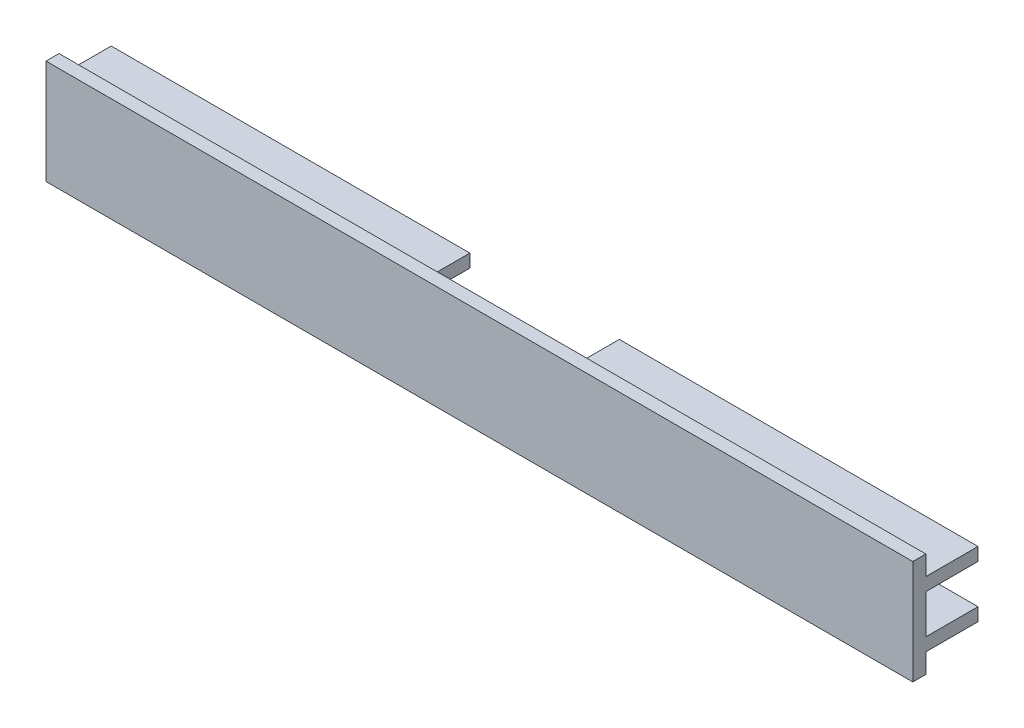
ISO-10303-21;
HEADER;
FILE_DESCRIPTION(('STEP AP214'),'2;1');
FILE_NAME('part.step','',(''),(''),'','','');
FILE_SCHEMA(('AUTOMOTIVE_DESIGN { 1 0 10303 214 1 1 1 1 }'));
ENDSEC;
DATA;
#1=APPLICATION_CONTEXT('core data for automotive mechanical design processes');
#2=APPLICATION_PROTOCOL_DEFINITION('international standard','automotive_design',2000,#1);
#3=PRODUCT_CONTEXT('',#1,'mechanical');
#4=PRODUCT('Part','Part','',(#3));
#5=PRODUCT_RELATED_PRODUCT_CATEGORY('part','',(#4));
#6=PRODUCT_DEFINITION_FORMATION('','',#4);
#7=PRODUCT_DEFINITION_CONTEXT('part definition',#1,'design');
#8=PRODUCT_DEFINITION('design','',#6,#7);
#9=PRODUCT_DEFINITION_SHAPE('','',#8);
#10=(LENGTH_UNIT() NAMED_UNIT(*) SI_UNIT(.MILLI.,.METRE.));
#11=(NAMED_UNIT(*) PLANE_ANGLE_UNIT() SI_UNIT($,.RADIAN.));
#12=(NAMED_UNIT(*) SI_UNIT($,.STERADIAN.) SOLID_ANGLE_UNIT());
#13=UNCERTAINTY_MEASURE_WITH_UNIT(LENGTH_MEASURE(1.E-05),#10,'distance_accuracy_value','');
#14=(GEOMETRIC_REPRESENTATION_CONTEXT(3) GLOBAL_UNCERTAINTY_ASSIGNED_CONTEXT((#13)) GLOBAL_UNIT_ASSIGNED_CONTEXT((#10,
#11,#12)) REPRESENTATION_CONTEXT('',''));
#15=CARTESIAN_POINT('',(0.,0.,0.));
#16=DIRECTION('',(0.,0.,1.));
#17=DIRECTION('',(1.,0.,0.));
#18=AXIS2_PLACEMENT_3D('',#15,#16,#17);
#19=CARTESIAN_POINT('',(66.46,-3.,-5.));
#20=DIRECTION('',(0.,0.,1.));
#21=DIRECTION('',(1.,0.,0.));
#22=AXIS2_PLACEMENT_3D('',#19,#20,#21);
#23=PLANE('',#22);
#24=DIRECTION('',(-1.,0.,0.));
#25=VECTOR('',#24,1.);
#26=CARTESIAN_POINT('',(66.46,-5.,-5.));
#27=LINE('',#26,#25);
#28=CARTESIAN_POINT('',(66.46,-5.,-5.));
#29=VERTEX_POINT('',#28);
#30=CARTESIAN_POINT('',(11.46,-5.,-5.));
#31=VERTEX_POINT('',#30);
#32=EDGE_CURVE('E353',#29,#31,#27,.T.);
#33=ORIENTED_EDGE('',*,*,#32,.T.);
#34=DIRECTION('',(0.,-1.,0.));
#35=VECTOR('',#34,1.);
#36=CARTESIAN_POINT('',(11.46,5.,-5.));
#37=LINE('',#36,#35);
#38=CARTESIAN_POINT('',(11.46,-3.,-5.));
#39=VERTEX_POINT('',#38);
#40=EDGE_CURVE('E420',#39,#31,#37,.T.);
#41=ORIENTED_EDGE('',*,*,#40,.F.);
#42=DIRECTION('',(-1.,0.,0.));
#43=VECTOR('',#42,1.);
#44=CARTESIAN_POINT('',(66.46,-3.,-5.));
#45=LINE('',#44,#43);
#46=CARTESIAN_POINT('',(66.46,-3.,-5.));
#47=VERTEX_POINT('',#46);
#48=EDGE_CURVE('E349',#47,#39,#45,.T.);
#49=ORIENTED_EDGE('',*,*,#48,.F.);
#50=DIRECTION('',(0.,1.,0.));
#51=VECTOR('',#50,1.);
#52=CARTESIAN_POINT('',(66.46,-3.,-5.));
#53=LINE('',#52,#51);
#54=EDGE_CURVE('E287',#29,#47,#53,.T.);
#55=ORIENTED_EDGE('',*,*,#54,.F.);
#56=EDGE_LOOP('',(#33,#41,#49,#55));
#57=FACE_BOUND('',#56,.T.);
#58=ADVANCED_FACE('F34',(#57),#23,.F.);
#59=CARTESIAN_POINT('',(66.46,-3.,2.));
#60=DIRECTION('',(0.,-1.,0.));
#61=DIRECTION('',(0.,0.,-1.));
#62=AXIS2_PLACEMENT_3D('',#59,#60,#61);
#63=PLANE('',#62);
#64=ORIENTED_EDGE('',*,*,#48,.T.);
#65=DIRECTION('',(0.,0.,1.));
#66=VECTOR('',#65,1.);
#67=CARTESIAN_POINT('',(11.46,-3.,2.));
#68=LINE('',#67,#66);
#69=CARTESIAN_POINT('',(11.46,-3.,2.));
#70=VERTEX_POINT('',#69);
#71=EDGE_CURVE('E235',#39,#70,#68,.T.);
#72=ORIENTED_EDGE('',*,*,#71,.T.);
#73=DIRECTION('',(-1.,0.,0.));
#74=VECTOR('',#73,1.);
#75=CARTESIAN_POINT('',(66.46,-3.,2.));
#76=LINE('',#75,#74);
#77=CARTESIAN_POINT('',(34.46,-3.,2.));
#78=VERTEX_POINT('',#77);
#79=EDGE_CURVE('E345',#78,#70,#76,.T.);
#80=ORIENTED_EDGE('',*,*,#79,.F.);
#81=DIRECTION('',(0.,0.,-1.));
#82=VECTOR('',#81,1.);
#83=CARTESIAN_POINT('',(34.46,-3.,3.));
#84=LINE('',#83,#82);
#85=CARTESIAN_POINT('',(34.46,-3.,3.));
#86=VERTEX_POINT('',#85);
#87=EDGE_CURVE('E251',#86,#78,#84,.T.);
#88=ORIENTED_EDGE('',*,*,#87,.F.);
#89=DIRECTION('',(1.,0.,0.));
#90=VECTOR('',#89,1.);
#91=CARTESIAN_POINT('',(34.46,-3.,3.));
#92=LINE('',#91,#90);
#93=CARTESIAN_POINT('',(66.46,-3.,3.));
#94=VERTEX_POINT('',#93);
#95=EDGE_CURVE('E256',#86,#94,#92,.T.);
#96=ORIENTED_EDGE('',*,*,#95,.T.);
#97=DIRECTION('',(0.,0.,1.));
#98=VECTOR('',#97,1.);
#99=CARTESIAN_POINT('',(66.46,-3.,2.));
#100=LINE('',#99,#98);
#101=EDGE_CURVE('E289',#47,#94,#100,.T.);
#102=ORIENTED_EDGE('',*,*,#101,.F.);
#103=EDGE_LOOP('',(#64,#72,#80,#88,#96,#102));
#104=FACE_BOUND('',#103,.T.);
#105=ADVANCED_FACE('F439',(#104),#63,.F.);
#106=CARTESIAN_POINT('',(66.46,3.,-5.));
#107=DIRECTION('',(0.,1.,0.));
#108=DIRECTION('',(0.,0.,1.));
#109=AXIS2_PLACEMENT_3D('',#106,#107,#108);
#110=PLANE('',#109);
#111=DIRECTION('',(-1.,0.,0.));
#112=VECTOR('',#111,1.);
#113=CARTESIAN_POINT('',(66.46,3.,2.));
#114=LINE('',#113,#112);
#115=CARTESIAN_POINT('',(34.46,3.,2.));
#116=VERTEX_POINT('',#115);
#117=CARTESIAN_POINT('',(11.46,3.,2.));
#118=VERTEX_POINT('',#117);
#119=EDGE_CURVE('E342',#116,#118,#114,.T.);
#120=ORIENTED_EDGE('',*,*,#119,.T.);
#121=DIRECTION('',(0.,0.,-1.));
#122=VECTOR('',#121,1.);
#123=CARTESIAN_POINT('',(11.46,3.,-5.));
#124=LINE('',#123,#122);
#125=CARTESIAN_POINT('',(11.46,3.,-5.));
#126=VERTEX_POINT('',#125);
#127=EDGE_CURVE('E202',#118,#126,#124,.T.);
#128=ORIENTED_EDGE('',*,*,#127,.T.);
#129=DIRECTION('',(-1.,0.,0.));
#130=VECTOR('',#129,1.);
#131=CARTESIAN_POINT('',(66.46,3.,-5.));
#132=LINE('',#131,#130);
#133=CARTESIAN_POINT('',(66.46,3.,-5.));
#134=VERTEX_POINT('',#133);
#135=EDGE_CURVE('E338',#134,#126,#132,.T.);
#136=ORIENTED_EDGE('',*,*,#135,.F.);
#137=DIRECTION('',(0.,0.,-1.));
#138=VECTOR('',#137,1.);
#139=CARTESIAN_POINT('',(66.46,3.,-5.));
#140=LINE('',#139,#138);
#141=CARTESIAN_POINT('',(66.46,3.,3.));
#142=VERTEX_POINT('',#141);
#143=EDGE_CURVE('E291',#142,#134,#140,.T.);
#144=ORIENTED_EDGE('',*,*,#143,.F.);
#145=DIRECTION('',(1.,0.,0.));
#146=VECTOR('',#145,1.);
#147=CARTESIAN_POINT('',(34.46,3.,3.));
#148=LINE('',#147,#146);
#149=CARTESIAN_POINT('',(34.46,3.,3.));
#150=VERTEX_POINT('',#149);
#151=EDGE_CURVE('E253',#150,#142,#148,.T.);
#152=ORIENTED_EDGE('',*,*,#151,.F.);
#153=DIRECTION('',(0.,0.,1.));
#154=VECTOR('',#153,1.);
#155=CARTESIAN_POINT('',(34.46,3.,2.));
#156=LINE('',#155,#154);
#157=EDGE_CURVE('E248',#116,#150,#156,.T.);
#158=ORIENTED_EDGE('',*,*,#157,.F.);
#159=EDGE_LOOP('',(#120,#128,#136,#144,#152,#158));
#160=FACE_BOUND('',#159,.T.);
#161=ADVANCED_FACE('F449',(#160),#110,.F.);
#162=CARTESIAN_POINT('',(66.46,5.,-5.));
#163=DIRECTION('',(0.,0.,1.));
#164=DIRECTION('',(1.,0.,0.));
#165=AXIS2_PLACEMENT_3D('',#162,#163,#164);
#166=PLANE('',#165);
#167=ORIENTED_EDGE('',*,*,#135,.T.);
#168=CARTESIAN_POINT('',(11.46,5.,-5.));
#169=VERTEX_POINT('',#168);
#170=EDGE_CURVE('E215',#169,#126,#37,.T.);
#171=ORIENTED_EDGE('',*,*,#170,.F.);
#172=DIRECTION('',(-1.,0.,0.));
#173=VECTOR('',#172,1.);
#174=CARTESIAN_POINT('',(66.46,5.,-5.));
#175=LINE('',#174,#173);
#176=CARTESIAN_POINT('',(66.46,5.,-5.));
#177=VERTEX_POINT('',#176);
#178=EDGE_CURVE('E221',#177,#169,#175,.T.);
#179=ORIENTED_EDGE('',*,*,#178,.F.);
#180=DIRECTION('',(0.,1.,0.));
#181=VECTOR('',#180,1.);
#182=CARTESIAN_POINT('',(66.46,5.,-5.));
#183=LINE('',#182,#181);
#184=EDGE_CURVE('E293',#134,#177,#183,.T.);
#185=ORIENTED_EDGE('',*,*,#184,.F.);
#186=EDGE_LOOP('',(#167,#171,#179,#185));
#187=FACE_BOUND('',#186,.T.);
#188=ADVANCED_FACE('F452',(#187),#166,.F.);
#189=CARTESIAN_POINT('',(66.46,3.,2.));
#190=DIRECTION('',(0.,0.,1.));
#191=DIRECTION('',(0.,-1.,0.));
#192=AXIS2_PLACEMENT_3D('',#189,#190,#191);
#193=PLANE('',#192);
#194=CARTESIAN_POINT('',(-11.46,3.,2.));
#195=VERTEX_POINT('',#194);
#196=CARTESIAN_POINT('',(-34.46,3.,2.));
#197=VERTEX_POINT('',#196);
#198=EDGE_CURVE('E341',#195,#197,#114,.T.);
#199=ORIENTED_EDGE('',*,*,#198,.F.);
#200=DIRECTION('',(0.,1.,0.));
#201=VECTOR('',#200,1.);
#202=CARTESIAN_POINT('',(-11.46,5.,2.));
#203=LINE('',#202,#201);
#204=CARTESIAN_POINT('',(-11.46,5.,2.));
#205=VERTEX_POINT('',#204);
#206=EDGE_CURVE('E213',#195,#205,#203,.T.);
#207=ORIENTED_EDGE('',*,*,#206,.T.);
#208=DIRECTION('',(1.,0.,0.));
#209=VECTOR('',#208,1.);
#210=CARTESIAN_POINT('',(11.46,5.,2.));
#211=LINE('',#210,#209);
#212=CARTESIAN_POINT('',(11.46,5.,2.));
#213=VERTEX_POINT('',#212);
#214=EDGE_CURVE('E210',#205,#213,#211,.T.);
#215=ORIENTED_EDGE('',*,*,#214,.T.);
#216=DIRECTION('',(0.,-1.,0.));
#217=VECTOR('',#216,1.);
#218=CARTESIAN_POINT('',(11.46,5.,2.));
#219=LINE('',#218,#217);
#220=EDGE_CURVE('E195',#213,#118,#219,.T.);
#221=ORIENTED_EDGE('',*,*,#220,.T.);
#222=ORIENTED_EDGE('',*,*,#119,.F.);
#223=CARTESIAN_POINT('',(34.46,0.,2.));
#224=DIRECTION('',(0.,0.,-1.));
#225=DIRECTION('',(0.,1.,0.));
#226=AXIS2_PLACEMENT_3D('',#223,#224,#225);
#227=CIRCLE('',#226,3.);
#228=EDGE_CURVE('E243',#78,#116,#227,.T.);
#229=ORIENTED_EDGE('',*,*,#228,.F.);
#230=ORIENTED_EDGE('',*,*,#79,.T.);
#231=CARTESIAN_POINT('',(11.46,-5.,2.));
#232=VERTEX_POINT('',#231);
#233=EDGE_CURVE('E207',#70,#232,#219,.T.);
#234=ORIENTED_EDGE('',*,*,#233,.T.);
#235=DIRECTION('',(-1.,0.,0.));
#236=VECTOR('',#235,1.);
#237=CARTESIAN_POINT('',(11.46,-5.,2.));
#238=LINE('',#237,#236);
#239=CARTESIAN_POINT('',(-11.46,-5.,2.));
#240=VERTEX_POINT('',#239);
#241=EDGE_CURVE('E426',#232,#240,#238,.T.);
#242=ORIENTED_EDGE('',*,*,#241,.T.);
#243=CARTESIAN_POINT('',(-11.46,-3.,2.));
#244=VERTEX_POINT('',#243);
#245=EDGE_CURVE('E229',#240,#244,#203,.T.);
#246=ORIENTED_EDGE('',*,*,#245,.T.);
#247=CARTESIAN_POINT('',(-34.46,-3.,2.));
#248=VERTEX_POINT('',#247);
#249=EDGE_CURVE('E344',#244,#248,#76,.T.);
#250=ORIENTED_EDGE('',*,*,#249,.T.);
#251=CARTESIAN_POINT('',(-34.46,0.,2.));
#252=DIRECTION('',(0.,0.,-1.));
#253=DIRECTION('',(0.,1.,0.));
#254=AXIS2_PLACEMENT_3D('',#251,#252,#253);
#255=CIRCLE('',#254,3.);
#256=EDGE_CURVE('E238',#197,#248,#255,.T.);
#257=ORIENTED_EDGE('',*,*,#256,.F.);
#258=EDGE_LOOP('',(#199,#207,#215,#221,#222,#229,#230,#234,#242,#246,#250,#257));
#259=FACE_BOUND('',#258,.T.);
#260=ADVANCED_FACE('F212',(#259),#193,.F.);
#261=CARTESIAN_POINT('',(66.46,8.,5.));
#262=DIRECTION('',(0.,0.,-1.));
#263=DIRECTION('',(-1.,0.,0.));
#264=AXIS2_PLACEMENT_3D('',#261,#262,#263);
#265=PLANE('',#264);
#266=DIRECTION('',(0.,-1.,0.));
#267=VECTOR('',#266,1.);
#268=CARTESIAN_POINT('',(-66.46,8.,5.));
#269=LINE('',#268,#267);
#270=CARTESIAN_POINT('',(-66.46,8.,5.));
#271=VERTEX_POINT('',#270);
#272=CARTESIAN_POINT('',(-66.46,-8.,5.));
#273=VERTEX_POINT('',#272);
#274=EDGE_CURVE('E274',#271,#273,#269,.T.);
#275=ORIENTED_EDGE('',*,*,#274,.T.);
#276=DIRECTION('',(-1.,0.,0.));
#277=VECTOR('',#276,1.);
#278=CARTESIAN_POINT('',(66.46,-8.,5.));
#279=LINE('',#278,#277);
#280=CARTESIAN_POINT('',(66.46,-8.,5.));
#281=VERTEX_POINT('',#280);
#282=EDGE_CURVE('E11',#281,#273,#279,.T.);
#283=ORIENTED_EDGE('',*,*,#282,.F.);
#284=DIRECTION('',(0.,-1.,0.));
#285=VECTOR('',#284,1.);
#286=CARTESIAN_POINT('',(66.46,8.,5.));
#287=LINE('',#286,#285);
#288=CARTESIAN_POINT('',(66.46,8.,5.));
#289=VERTEX_POINT('',#288);
#290=EDGE_CURVE('E277',#289,#281,#287,.T.);
#291=ORIENTED_EDGE('',*,*,#290,.F.);
#292=DIRECTION('',(-1.,0.,0.));
#293=VECTOR('',#292,1.);
#294=CARTESIAN_POINT('',(66.46,8.,5.));
#295=LINE('',#294,#293);
#296=EDGE_CURVE('E301',#289,#271,#295,.T.);
#297=ORIENTED_EDGE('',*,*,#296,.T.);
#298=EDGE_LOOP('',(#275,#283,#291,#297));
#299=FACE_BOUND('',#298,.T.);
#300=ADVANCED_FACE('F36',(#299),#265,.F.);
#301=CARTESIAN_POINT('',(66.46,-8.,5.));
#302=DIRECTION('',(0.,1.,0.));
#303=DIRECTION('',(0.,0.,1.));
#304=AXIS2_PLACEMENT_3D('',#301,#302,#303);
#305=PLANE('',#304);
#306=DIRECTION('',(0.,0.,-1.));
#307=VECTOR('',#306,1.);
#308=CARTESIAN_POINT('',(-66.46,-8.,5.));
#309=LINE('',#308,#307);
#310=CARTESIAN_POINT('',(-66.46,-8.,3.));
#311=VERTEX_POINT('',#310);
#312=EDGE_CURVE('E304',#273,#311,#309,.T.);
#313=ORIENTED_EDGE('',*,*,#312,.T.);
#314=DIRECTION('',(-1.,0.,0.));
#315=VECTOR('',#314,1.);
#316=CARTESIAN_POINT('',(66.46,-8.,3.));
#317=LINE('',#316,#315);
#318=CARTESIAN_POINT('',(66.46,-8.,3.));
#319=VERTEX_POINT('',#318);
#320=EDGE_CURVE('E42',#319,#311,#317,.T.);
#321=ORIENTED_EDGE('',*,*,#320,.F.);
#322=DIRECTION('',(0.,0.,-1.));
#323=VECTOR('',#322,1.);
#324=CARTESIAN_POINT('',(66.46,-8.,5.));
#325=LINE('',#324,#323);
#326=EDGE_CURVE('E280',#281,#319,#325,.T.);
#327=ORIENTED_EDGE('',*,*,#326,.F.);
#328=ORIENTED_EDGE('',*,*,#282,.T.);
#329=EDGE_LOOP('',(#313,#321,#327,#328));
#330=FACE_BOUND('',#329,.T.);
#331=ADVANCED_FACE('F386',(#330),#305,.F.);
#332=CARTESIAN_POINT('',(66.46,-5.,3.));
#333=DIRECTION('',(0.,0.,1.));
#334=DIRECTION('',(0.,-1.,0.));
#335=AXIS2_PLACEMENT_3D('',#332,#333,#334);
#336=PLANE('',#335);
#337=DIRECTION('',(0.,1.,0.));
#338=VECTOR('',#337,1.);
#339=CARTESIAN_POINT('',(-66.46,-5.,3.));
#340=LINE('',#339,#338);
#341=CARTESIAN_POINT('',(-66.46,-5.,3.));
#342=VERTEX_POINT('',#341);
#343=EDGE_CURVE('E306',#311,#342,#340,.T.);
#344=ORIENTED_EDGE('',*,*,#343,.T.);
#345=DIRECTION('',(-1.,0.,0.));
#346=VECTOR('',#345,1.);
#347=CARTESIAN_POINT('',(66.46,-5.,3.));
#348=LINE('',#347,#346);
#349=CARTESIAN_POINT('',(66.46,-5.,3.));
#350=VERTEX_POINT('',#349);
#351=EDGE_CURVE('E356',#350,#342,#348,.T.);
#352=ORIENTED_EDGE('',*,*,#351,.F.);
#353=DIRECTION('',(0.,1.,0.));
#354=VECTOR('',#353,1.);
#355=CARTESIAN_POINT('',(66.46,-5.,3.));
#356=LINE('',#355,#354);
#357=EDGE_CURVE('E283',#319,#350,#356,.T.);
#358=ORIENTED_EDGE('',*,*,#357,.F.);
#359=ORIENTED_EDGE('',*,*,#320,.T.);
#360=EDGE_LOOP('',(#344,#352,#358,#359));
#361=FACE_BOUND('',#360,.T.);
#362=ADVANCED_FACE('F363',(#361),#336,.F.);
#363=CARTESIAN_POINT('',(66.46,-5.,-5.));
#364=DIRECTION('',(0.,1.,0.));
#365=DIRECTION('',(0.,0.,1.));
#366=AXIS2_PLACEMENT_3D('',#363,#364,#365);
#367=PLANE('',#366);
#368=ORIENTED_EDGE('',*,*,#241,.F.);
#369=DIRECTION('',(0.,0.,-1.));
#370=VECTOR('',#369,1.);
#371=CARTESIAN_POINT('',(11.46,-5.,27.0065271479268));
#372=LINE('',#371,#370);
#373=EDGE_CURVE('E206',#232,#31,#372,.T.);
#374=ORIENTED_EDGE('',*,*,#373,.T.);
#375=ORIENTED_EDGE('',*,*,#32,.F.);
#376=DIRECTION('',(0.,0.,-1.));
#377=VECTOR('',#376,1.);
#378=CARTESIAN_POINT('',(66.46,-5.,-5.));
#379=LINE('',#378,#377);
#380=EDGE_CURVE('E285',#350,#29,#379,.T.);
#381=ORIENTED_EDGE('',*,*,#380,.F.);
#382=ORIENTED_EDGE('',*,*,#351,.T.);
#383=DIRECTION('',(0.,0.,-1.));
#384=VECTOR('',#383,1.);
#385=CARTESIAN_POINT('',(-66.46,-5.,-5.));
#386=LINE('',#385,#384);
#387=CARTESIAN_POINT('',(-66.46,-5.,-5.));
#388=VERTEX_POINT('',#387);
#389=EDGE_CURVE('E308',#342,#388,#386,.T.);
#390=ORIENTED_EDGE('',*,*,#389,.T.);
#391=CARTESIAN_POINT('',(-11.46,-5.,-5.));
#392=VERTEX_POINT('',#391);
#393=EDGE_CURVE('E352',#392,#388,#27,.T.);
#394=ORIENTED_EDGE('',*,*,#393,.F.);
#395=DIRECTION('',(0.,0.,-1.));
#396=VECTOR('',#395,1.);
#397=CARTESIAN_POINT('',(-11.46,-5.,27.0065271479268));
#398=LINE('',#397,#396);
#399=EDGE_CURVE('E428',#240,#392,#398,.T.);
#400=ORIENTED_EDGE('',*,*,#399,.F.);
#401=EDGE_LOOP('',(#368,#374,#375,#381,#382,#390,#394,#400));
#402=FACE_BOUND('',#401,.T.);
#403=ADVANCED_FACE('F375',(#402),#367,.F.);
#404=CARTESIAN_POINT('',(-11.46,-3.,-5.));
#405=VERTEX_POINT('',#404);
#406=CARTESIAN_POINT('',(-66.46,-3.,-5.));
#407=VERTEX_POINT('',#406);
#408=EDGE_CURVE('E348',#405,#407,#45,.T.);
#409=ORIENTED_EDGE('',*,*,#408,.F.);
#410=DIRECTION('',(0.,1.,0.));
#411=VECTOR('',#410,1.);
#412=CARTESIAN_POINT('',(-11.46,5.,-5.));
#413=LINE('',#412,#411);
#414=EDGE_CURVE('E49',#392,#405,#413,.T.);
#415=ORIENTED_EDGE('',*,*,#414,.F.);
#416=ORIENTED_EDGE('',*,*,#393,.T.);
#417=DIRECTION('',(0.,1.,0.));
#418=VECTOR('',#417,1.);
#419=CARTESIAN_POINT('',(-66.46,-3.,-5.));
#420=LINE('',#419,#418);
#421=EDGE_CURVE('E311',#388,#407,#420,.T.);
#422=ORIENTED_EDGE('',*,*,#421,.T.);
#423=EDGE_LOOP('',(#409,#415,#416,#422));
#424=FACE_BOUND('',#423,.T.);
#425=ADVANCED_FACE('F419',(#424),#23,.F.);
#426=ORIENTED_EDGE('',*,*,#249,.F.);
#427=DIRECTION('',(0.,0.,-1.));
#428=VECTOR('',#427,1.);
#429=CARTESIAN_POINT('',(-11.46,-3.,2.));
#430=LINE('',#429,#428);
#431=EDGE_CURVE('E232',#244,#405,#430,.T.);
#432=ORIENTED_EDGE('',*,*,#431,.T.);
#433=ORIENTED_EDGE('',*,*,#408,.T.);
#434=DIRECTION('',(0.,0.,1.));
#435=VECTOR('',#434,1.);
#436=CARTESIAN_POINT('',(-66.46,-3.,2.));
#437=LINE('',#436,#435);
#438=CARTESIAN_POINT('',(-66.46,-3.,3.));
#439=VERTEX_POINT('',#438);
#440=EDGE_CURVE('E314',#407,#439,#437,.T.);
#441=ORIENTED_EDGE('',*,*,#440,.T.);
#442=DIRECTION('',(-1.,0.,0.));
#443=VECTOR('',#442,1.);
#444=CARTESIAN_POINT('',(-34.46,-3.,3.));
#445=LINE('',#444,#443);
#446=CARTESIAN_POINT('',(-34.46,-3.,3.));
#447=VERTEX_POINT('',#446);
#448=EDGE_CURVE('E268',#447,#439,#445,.T.);
#449=ORIENTED_EDGE('',*,*,#448,.F.);
#450=DIRECTION('',(0.,0.,1.));
#451=VECTOR('',#450,1.);
#452=CARTESIAN_POINT('',(-34.46,-3.,3.));
#453=LINE('',#452,#451);
#454=EDGE_CURVE('E262',#248,#447,#453,.T.);
#455=ORIENTED_EDGE('',*,*,#454,.F.);
#456=EDGE_LOOP('',(#426,#432,#433,#441,#449,#455));
#457=FACE_BOUND('',#456,.T.);
#458=ADVANCED_FACE('F415',(#457),#63,.F.);
#459=CARTESIAN_POINT('',(-11.46,3.,-5.));
#460=VERTEX_POINT('',#459);
#461=CARTESIAN_POINT('',(-66.46,3.,-5.));
#462=VERTEX_POINT('',#461);
#463=EDGE_CURVE('E337',#460,#462,#132,.T.);
#464=ORIENTED_EDGE('',*,*,#463,.F.);
#465=DIRECTION('',(0.,0.,1.));
#466=VECTOR('',#465,1.);
#467=CARTESIAN_POINT('',(-11.46,3.,-5.));
#468=LINE('',#467,#466);
#469=EDGE_CURVE('E228',#460,#195,#468,.T.);
#470=ORIENTED_EDGE('',*,*,#469,.T.);
#471=ORIENTED_EDGE('',*,*,#198,.T.);
#472=DIRECTION('',(0.,0.,-1.));
#473=VECTOR('',#472,1.);
#474=CARTESIAN_POINT('',(-34.46,3.,2.));
#475=LINE('',#474,#473);
#476=CARTESIAN_POINT('',(-34.46,3.,3.));
#477=VERTEX_POINT('',#476);
#478=EDGE_CURVE('E265',#477,#197,#475,.T.);
#479=ORIENTED_EDGE('',*,*,#478,.F.);
#480=DIRECTION('',(-1.,0.,0.));
#481=VECTOR('',#480,1.);
#482=CARTESIAN_POINT('',(-34.46,3.,3.));
#483=LINE('',#482,#481);
#484=CARTESIAN_POINT('',(-66.46,3.,3.));
#485=VERTEX_POINT('',#484);
#486=EDGE_CURVE('E271',#477,#485,#483,.T.);
#487=ORIENTED_EDGE('',*,*,#486,.T.);
#488=DIRECTION('',(0.,0.,-1.));
#489=VECTOR('',#488,1.);
#490=CARTESIAN_POINT('',(-66.46,3.,-5.));
#491=LINE('',#490,#489);
#492=EDGE_CURVE('E316',#485,#462,#491,.T.);
#493=ORIENTED_EDGE('',*,*,#492,.T.);
#494=EDGE_LOOP('',(#464,#470,#471,#479,#487,#493));
#495=FACE_BOUND('',#494,.T.);
#496=ADVANCED_FACE('F407',(#495),#110,.F.);
#497=CARTESIAN_POINT('',(-11.46,5.,-5.));
#498=VERTEX_POINT('',#497);
#499=CARTESIAN_POINT('',(-66.46,5.,-5.));
#500=VERTEX_POINT('',#499);
#501=EDGE_CURVE('E335',#498,#500,#175,.T.);
#502=ORIENTED_EDGE('',*,*,#501,.F.);
#503=EDGE_CURVE('E57',#460,#498,#413,.T.);
#504=ORIENTED_EDGE('',*,*,#503,.F.);
#505=ORIENTED_EDGE('',*,*,#463,.T.);
#506=DIRECTION('',(0.,1.,0.));
#507=VECTOR('',#506,1.);
#508=CARTESIAN_POINT('',(-66.46,5.,-5.));
#509=LINE('',#508,#507);
#510=EDGE_CURVE('E319',#462,#500,#509,.T.);
#511=ORIENTED_EDGE('',*,*,#510,.T.);
#512=EDGE_LOOP('',(#502,#504,#505,#511));
#513=FACE_BOUND('',#512,.T.);
#514=ADVANCED_FACE('F404',(#513),#166,.F.);
#515=CARTESIAN_POINT('',(66.46,5.,3.));
#516=DIRECTION('',(0.,-1.,0.));
#517=DIRECTION('',(0.,0.,-1.));
#518=AXIS2_PLACEMENT_3D('',#515,#516,#517);
#519=PLANE('',#518);
#520=ORIENTED_EDGE('',*,*,#178,.T.);
#521=DIRECTION('',(0.,0.,-1.));
#522=VECTOR('',#521,1.);
#523=CARTESIAN_POINT('',(11.46,5.,27.0065271479268));
#524=LINE('',#523,#522);
#525=EDGE_CURVE('E199',#213,#169,#524,.T.);
#526=ORIENTED_EDGE('',*,*,#525,.F.);
#527=ORIENTED_EDGE('',*,*,#214,.F.);
#528=DIRECTION('',(0.,0.,-1.));
#529=VECTOR('',#528,1.);
#530=CARTESIAN_POINT('',(-11.46,5.,27.0065271479268));
#531=LINE('',#530,#529);
#532=EDGE_CURVE('E226',#205,#498,#531,.T.);
#533=ORIENTED_EDGE('',*,*,#532,.T.);
#534=ORIENTED_EDGE('',*,*,#501,.T.);
#535=DIRECTION('',(0.,0.,1.));
#536=VECTOR('',#535,1.);
#537=CARTESIAN_POINT('',(-66.46,5.,3.));
#538=LINE('',#537,#536);
#539=CARTESIAN_POINT('',(-66.46,5.,3.));
#540=VERTEX_POINT('',#539);
#541=EDGE_CURVE('E322',#500,#540,#538,.T.);
#542=ORIENTED_EDGE('',*,*,#541,.T.);
#543=DIRECTION('',(-1.,0.,0.));
#544=VECTOR('',#543,1.);
#545=CARTESIAN_POINT('',(66.46,5.,3.));
#546=LINE('',#545,#544);
#547=CARTESIAN_POINT('',(66.46,5.,3.));
#548=VERTEX_POINT('',#547);
#549=EDGE_CURVE('E332',#548,#540,#546,.T.);
#550=ORIENTED_EDGE('',*,*,#549,.F.);
#551=DIRECTION('',(0.,0.,1.));
#552=VECTOR('',#551,1.);
#553=CARTESIAN_POINT('',(66.46,5.,3.));
#554=LINE('',#553,#552);
#555=EDGE_CURVE('E295',#177,#548,#554,.T.);
#556=ORIENTED_EDGE('',*,*,#555,.F.);
#557=EDGE_LOOP('',(#520,#526,#527,#533,#534,#542,#550,#556));
#558=FACE_BOUND('',#557,.T.);
#559=ADVANCED_FACE('F218',(#558),#519,.F.);
#560=CARTESIAN_POINT('',(66.46,8.,3.));
#561=DIRECTION('',(0.,0.,1.));
#562=DIRECTION('',(0.,-1.,0.));
#563=AXIS2_PLACEMENT_3D('',#560,#561,#562);
#564=PLANE('',#563);
#565=DIRECTION('',(0.,1.,0.));
#566=VECTOR('',#565,1.);
#567=CARTESIAN_POINT('',(-66.46,8.,3.));
#568=LINE('',#567,#566);
#569=CARTESIAN_POINT('',(-66.46,8.,3.));
#570=VERTEX_POINT('',#569);
#571=EDGE_CURVE('E324',#540,#570,#568,.T.);
#572=ORIENTED_EDGE('',*,*,#571,.T.);
#573=DIRECTION('',(-1.,0.,0.));
#574=VECTOR('',#573,1.);
#575=CARTESIAN_POINT('',(66.46,8.,3.));
#576=LINE('',#575,#574);
#577=CARTESIAN_POINT('',(66.46,8.,3.));
#578=VERTEX_POINT('',#577);
#579=EDGE_CURVE('E329',#578,#570,#576,.T.);
#580=ORIENTED_EDGE('',*,*,#579,.F.);
#581=DIRECTION('',(0.,1.,0.));
#582=VECTOR('',#581,1.);
#583=CARTESIAN_POINT('',(66.46,8.,3.));
#584=LINE('',#583,#582);
#585=EDGE_CURVE('E297',#548,#578,#584,.T.);
#586=ORIENTED_EDGE('',*,*,#585,.F.);
#587=ORIENTED_EDGE('',*,*,#549,.T.);
#588=EDGE_LOOP('',(#572,#580,#586,#587));
#589=FACE_BOUND('',#588,.T.);
#590=ADVANCED_FACE('F398',(#589),#564,.F.);
#591=CARTESIAN_POINT('',(66.46,8.,5.));
#592=DIRECTION('',(0.,-1.,0.));
#593=DIRECTION('',(0.,0.,-1.));
#594=AXIS2_PLACEMENT_3D('',#591,#592,#593);
#595=PLANE('',#594);
#596=DIRECTION('',(0.,0.,1.));
#597=VECTOR('',#596,1.);
#598=CARTESIAN_POINT('',(-66.46,8.,5.));
#599=LINE('',#598,#597);
#600=EDGE_CURVE('E281',#570,#271,#599,.T.);
#601=ORIENTED_EDGE('',*,*,#600,.T.);
#602=ORIENTED_EDGE('',*,*,#296,.F.);
#603=DIRECTION('',(0.,0.,1.));
#604=VECTOR('',#603,1.);
#605=CARTESIAN_POINT('',(66.46,8.,5.));
#606=LINE('',#605,#604);
#607=EDGE_CURVE('E299',#578,#289,#606,.T.);
#608=ORIENTED_EDGE('',*,*,#607,.F.);
#609=ORIENTED_EDGE('',*,*,#579,.T.);
#610=EDGE_LOOP('',(#601,#602,#608,#609));
#611=FACE_BOUND('',#610,.T.);
#612=ADVANCED_FACE('F393',(#611),#595,.F.);
#613=CARTESIAN_POINT('',(66.46,-8.,5.));
#614=DIRECTION('',(1.,0.,0.));
#615=DIRECTION('',(0.,0.,-1.));
#616=AXIS2_PLACEMENT_3D('',#613,#614,#615);
#617=PLANE('',#616);
#618=ORIENTED_EDGE('',*,*,#101,.T.);
#619=DIRECTION('',(0.,-1.,0.));
#620=VECTOR('',#619,1.);
#621=CARTESIAN_POINT('',(66.46,3.,3.));
#622=LINE('',#621,#620);
#623=EDGE_CURVE('E247',#142,#94,#622,.T.);
#624=ORIENTED_EDGE('',*,*,#623,.F.);
#625=ORIENTED_EDGE('',*,*,#143,.T.);
#626=ORIENTED_EDGE('',*,*,#184,.T.);
#627=ORIENTED_EDGE('',*,*,#555,.T.);
#628=ORIENTED_EDGE('',*,*,#585,.T.);
#629=ORIENTED_EDGE('',*,*,#607,.T.);
#630=ORIENTED_EDGE('',*,*,#290,.T.);
#631=ORIENTED_EDGE('',*,*,#326,.T.);
#632=ORIENTED_EDGE('',*,*,#357,.T.);
#633=ORIENTED_EDGE('',*,*,#380,.T.);
#634=ORIENTED_EDGE('',*,*,#54,.T.);
#635=EDGE_LOOP('',(#618,#624,#625,#626,#627,#628,#629,#630,#631,#632,#633,#634));
#636=FACE_BOUND('',#635,.T.);
#637=ADVANCED_FACE('F382',(#636),#617,.T.);
#638=CARTESIAN_POINT('',(-66.46,-8.,5.));
#639=DIRECTION('',(1.,0.,0.));
#640=DIRECTION('',(0.,0.,-1.));
#641=AXIS2_PLACEMENT_3D('',#638,#639,#640);
#642=PLANE('',#641);
#643=ORIENTED_EDGE('',*,*,#492,.F.);
#644=DIRECTION('',(0.,1.,0.));
#645=VECTOR('',#644,1.);
#646=CARTESIAN_POINT('',(-66.46,3.,3.));
#647=LINE('',#646,#645);
#648=EDGE_CURVE('E259',#439,#485,#647,.T.);
#649=ORIENTED_EDGE('',*,*,#648,.F.);
#650=ORIENTED_EDGE('',*,*,#440,.F.);
#651=ORIENTED_EDGE('',*,*,#421,.F.);
#652=ORIENTED_EDGE('',*,*,#389,.F.);
#653=ORIENTED_EDGE('',*,*,#343,.F.);
#654=ORIENTED_EDGE('',*,*,#312,.F.);
#655=ORIENTED_EDGE('',*,*,#274,.F.);
#656=ORIENTED_EDGE('',*,*,#600,.F.);
#657=ORIENTED_EDGE('',*,*,#571,.F.);
#658=ORIENTED_EDGE('',*,*,#541,.F.);
#659=ORIENTED_EDGE('',*,*,#510,.F.);
#660=EDGE_LOOP('',(#643,#649,#650,#651,#652,#653,#654,#655,#656,#657,#658,#659));
#661=FACE_BOUND('',#660,.T.);
#662=ADVANCED_FACE('F368',(#661),#642,.F.);
#663=CARTESIAN_POINT('',(-34.46,3.,3.));
#664=DIRECTION('',(0.,0.,1.));
#665=DIRECTION('',(0.,-1.,0.));
#666=AXIS2_PLACEMENT_3D('',#663,#664,#665);
#667=PLANE('',#666);
#668=ORIENTED_EDGE('',*,*,#648,.T.);
#669=ORIENTED_EDGE('',*,*,#486,.F.);
#670=CARTESIAN_POINT('',(-34.46,0.,3.));
#671=DIRECTION('',(0.,0.,1.));
#672=DIRECTION('',(0.,-1.,0.));
#673=AXIS2_PLACEMENT_3D('',#670,#671,#672);
#674=CIRCLE('',#673,3.);
#675=EDGE_CURVE('E241',#477,#447,#674,.F.);
#676=ORIENTED_EDGE('',*,*,#675,.T.);
#677=ORIENTED_EDGE('',*,*,#448,.T.);
#678=EDGE_LOOP('',(#668,#669,#676,#677));
#679=FACE_BOUND('',#678,.T.);
#680=ADVANCED_FACE('F411',(#679),#667,.F.);
#681=CARTESIAN_POINT('',(34.46,3.,3.));
#682=DIRECTION('',(0.,0.,1.));
#683=DIRECTION('',(0.,-1.,0.));
#684=AXIS2_PLACEMENT_3D('',#681,#682,#683);
#685=PLANE('',#684);
#686=ORIENTED_EDGE('',*,*,#623,.T.);
#687=ORIENTED_EDGE('',*,*,#95,.F.);
#688=CARTESIAN_POINT('',(34.46,0.,3.));
#689=DIRECTION('',(0.,0.,1.));
#690=DIRECTION('',(0.,-1.,0.));
#691=AXIS2_PLACEMENT_3D('',#688,#689,#690);
#692=CIRCLE('',#691,3.);
#693=EDGE_CURVE('E245',#86,#150,#692,.F.);
#694=ORIENTED_EDGE('',*,*,#693,.T.);
#695=ORIENTED_EDGE('',*,*,#151,.T.);
#696=EDGE_LOOP('',(#686,#687,#694,#695));
#697=FACE_BOUND('',#696,.T.);
#698=ADVANCED_FACE('F445',(#697),#685,.F.);
#699=CARTESIAN_POINT('',(34.46,0.,9.70820393249937));
#700=DIRECTION('',(0.,0.,-1.));
#701=DIRECTION('',(0.,1.,0.));
#702=AXIS2_PLACEMENT_3D('',#699,#700,#701);
#703=CYLINDRICAL_SURFACE('',#702,3.);
#704=ORIENTED_EDGE('',*,*,#87,.T.);
#705=ORIENTED_EDGE('',*,*,#228,.T.);
#706=ORIENTED_EDGE('',*,*,#157,.T.);
#707=ORIENTED_EDGE('',*,*,#693,.F.);
#708=EDGE_LOOP('',(#704,#705,#706,#707));
#709=FACE_BOUND('',#708,.T.);
#710=ADVANCED_FACE('F575',(#709),#703,.F.);
#711=CARTESIAN_POINT('',(-34.46,0.,9.70820393249937));
#712=DIRECTION('',(0.,0.,-1.));
#713=DIRECTION('',(0.,1.,0.));
#714=AXIS2_PLACEMENT_3D('',#711,#712,#713);
#715=CYLINDRICAL_SURFACE('',#714,3.);
#716=ORIENTED_EDGE('',*,*,#478,.T.);
#717=ORIENTED_EDGE('',*,*,#256,.T.);
#718=ORIENTED_EDGE('',*,*,#454,.T.);
#719=ORIENTED_EDGE('',*,*,#675,.F.);
#720=EDGE_LOOP('',(#716,#717,#718,#719));
#721=FACE_BOUND('',#720,.T.);
#722=ADVANCED_FACE('F546',(#721),#715,.F.);
#723=CARTESIAN_POINT('',(11.46,5.,27.0065271479268));
#724=DIRECTION('',(1.,0.,0.));
#725=DIRECTION('',(0.,0.,-1.));
#726=AXIS2_PLACEMENT_3D('',#723,#724,#725);
#727=PLANE('',#726);
#728=ORIENTED_EDGE('',*,*,#220,.F.);
#729=ORIENTED_EDGE('',*,*,#525,.T.);
#730=ORIENTED_EDGE('',*,*,#170,.T.);
#731=ORIENTED_EDGE('',*,*,#127,.F.);
#732=EDGE_LOOP('',(#728,#729,#730,#731));
#733=FACE_BOUND('',#732,.T.);
#734=ADVANCED_FACE('F197',(#733),#727,.F.);
#735=CARTESIAN_POINT('',(-11.46,5.,27.0065271479268));
#736=DIRECTION('',(-1.,0.,0.));
#737=DIRECTION('',(0.,0.,1.));
#738=AXIS2_PLACEMENT_3D('',#735,#736,#737);
#739=PLANE('',#738);
#740=ORIENTED_EDGE('',*,*,#503,.T.);
#741=ORIENTED_EDGE('',*,*,#532,.F.);
#742=ORIENTED_EDGE('',*,*,#206,.F.);
#743=ORIENTED_EDGE('',*,*,#469,.F.);
#744=EDGE_LOOP('',(#740,#741,#742,#743));
#745=FACE_BOUND('',#744,.T.);
#746=ADVANCED_FACE('F545',(#745),#739,.F.);
#747=ORIENTED_EDGE('',*,*,#40,.T.);
#748=ORIENTED_EDGE('',*,*,#373,.F.);
#749=ORIENTED_EDGE('',*,*,#233,.F.);
#750=ORIENTED_EDGE('',*,*,#71,.F.);
#751=EDGE_LOOP('',(#747,#748,#749,#750));
#752=FACE_BOUND('',#751,.T.);
#753=ADVANCED_FACE('F434',(#752),#727,.F.);
#754=ORIENTED_EDGE('',*,*,#245,.F.);
#755=ORIENTED_EDGE('',*,*,#399,.T.);
#756=ORIENTED_EDGE('',*,*,#414,.T.);
#757=ORIENTED_EDGE('',*,*,#431,.F.);
#758=EDGE_LOOP('',(#754,#755,#756,#757));
#759=FACE_BOUND('',#758,.T.);
#760=ADVANCED_FACE('F429',(#759),#739,.F.);
#761=CLOSED_SHELL('',(#58,#105,#161,#188,#260,#300,#331,#362,#403,#425,#458,#496,#514,#559,#590,
#612,#637,#662,#680,#698,#710,#722,#734,#746,#753,#760));
#762=MANIFOLD_SOLID_BREP('B2',#761);
#763=ADVANCED_BREP_SHAPE_REPRESENTATION('',(#18,#762),#14);
#764=SHAPE_DEFINITION_REPRESENTATION(#9,#763);
ENDSEC;
END-ISO-10303-21;
